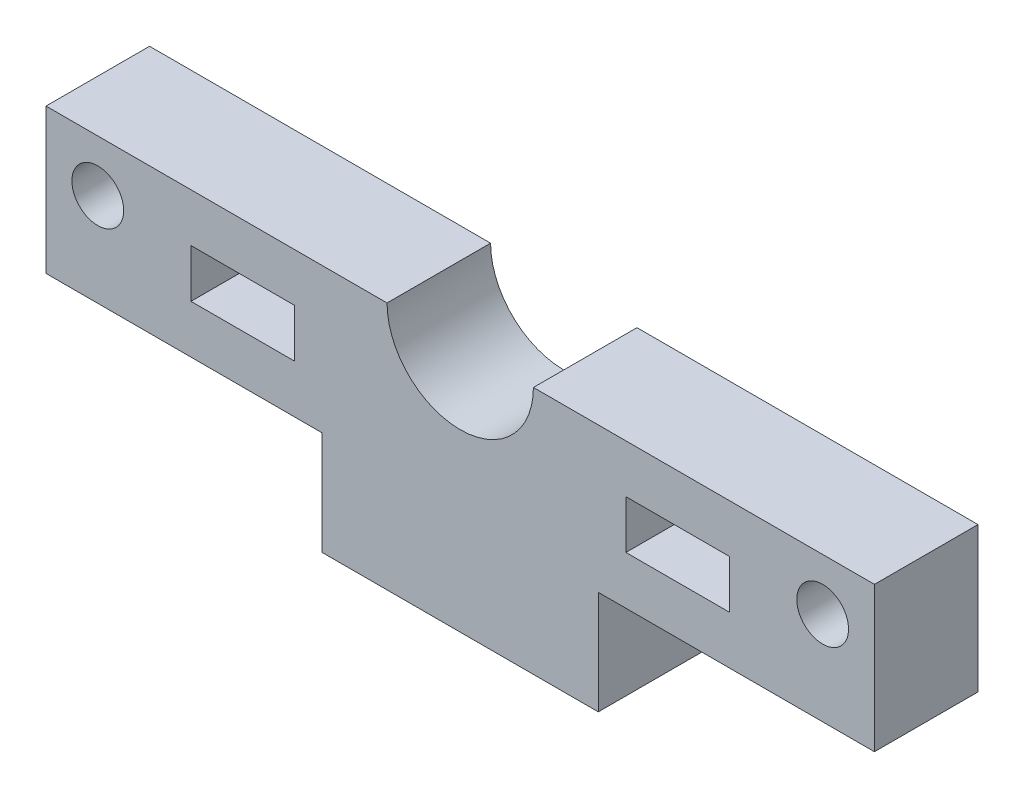
ISO-10303-21;
HEADER;
FILE_DESCRIPTION(('STEP AP214'),'2;1');
FILE_NAME('part.step','',(''),(''),'','','');
FILE_SCHEMA(('AUTOMOTIVE_DESIGN { 1 0 10303 214 1 1 1 1 }'));
ENDSEC;
DATA;
#1=APPLICATION_CONTEXT('core data for automotive mechanical design processes');
#2=APPLICATION_PROTOCOL_DEFINITION('international standard','automotive_design',2000,#1);
#3=PRODUCT_CONTEXT('',#1,'mechanical');
#4=PRODUCT('Part','Part','',(#3));
#5=PRODUCT_RELATED_PRODUCT_CATEGORY('part','',(#4));
#6=PRODUCT_DEFINITION_FORMATION('','',#4);
#7=PRODUCT_DEFINITION_CONTEXT('part definition',#1,'design');
#8=PRODUCT_DEFINITION('design','',#6,#7);
#9=PRODUCT_DEFINITION_SHAPE('','',#8);
#10=(LENGTH_UNIT() NAMED_UNIT(*) SI_UNIT(.MILLI.,.METRE.));
#11=(NAMED_UNIT(*) PLANE_ANGLE_UNIT() SI_UNIT($,.RADIAN.));
#12=(NAMED_UNIT(*) SI_UNIT($,.STERADIAN.) SOLID_ANGLE_UNIT());
#13=UNCERTAINTY_MEASURE_WITH_UNIT(LENGTH_MEASURE(1.E-05),#10,'distance_accuracy_value','');
#14=(GEOMETRIC_REPRESENTATION_CONTEXT(3) GLOBAL_UNCERTAINTY_ASSIGNED_CONTEXT((#13)) GLOBAL_UNIT_ASSIGNED_CONTEXT((#10,
#11,#12)) REPRESENTATION_CONTEXT('',''));
#15=CARTESIAN_POINT('',(0.,0.,0.));
#16=DIRECTION('',(0.,0.,1.));
#17=DIRECTION('',(1.,0.,0.));
#18=AXIS2_PLACEMENT_3D('',#15,#16,#17);
#19=CARTESIAN_POINT('',(0.,0.,6.35));
#20=DIRECTION('',(0.,0.,-1.));
#21=DIRECTION('',(-1.,0.,0.));
#22=AXIS2_PLACEMENT_3D('',#19,#20,#21);
#23=PLANE('',#22);
#24=DIRECTION('',(0.,1.,0.));
#25=VECTOR('',#24,1.);
#26=CARTESIAN_POINT('',(35.56,6.55436781609194,6.34999999999999));
#27=LINE('',#26,#25);
#28=CARTESIAN_POINT('',(35.56,6.55436781609194,6.34999999999999));
#29=VERTEX_POINT('',#28);
#30=CARTESIAN_POINT('',(35.56,9.51770114942527,6.34999999999999));
#31=VERTEX_POINT('',#30);
#32=EDGE_CURVE('E189',#29,#31,#27,.T.);
#33=ORIENTED_EDGE('',*,*,#32,.T.);
#34=DIRECTION('',(1.,0.,0.));
#35=VECTOR('',#34,1.);
#36=CARTESIAN_POINT('',(35.56,9.51770114942527,6.34999999999999));
#37=LINE('',#36,#35);
#38=CARTESIAN_POINT('',(41.91,9.51770114942527,6.34999999999999));
#39=VERTEX_POINT('',#38);
#40=EDGE_CURVE('E210',#31,#39,#37,.T.);
#41=ORIENTED_EDGE('',*,*,#40,.T.);
#42=DIRECTION('',(0.,1.,0.));
#43=VECTOR('',#42,1.);
#44=CARTESIAN_POINT('',(41.91,6.55436781609194,6.34999999999999));
#45=LINE('',#44,#43);
#46=CARTESIAN_POINT('',(41.91,6.55436781609194,6.35));
#47=VERTEX_POINT('',#46);
#48=EDGE_CURVE('E199',#47,#39,#45,.T.);
#49=ORIENTED_EDGE('',*,*,#48,.F.);
#50=DIRECTION('',(1.,0.,0.));
#51=VECTOR('',#50,1.);
#52=CARTESIAN_POINT('',(35.56,6.55436781609194,6.34999999999999));
#53=LINE('',#52,#51);
#54=EDGE_CURVE('E208',#29,#47,#53,.T.);
#55=ORIENTED_EDGE('',*,*,#54,.F.);
#56=EDGE_LOOP('',(#33,#41,#49,#55));
#57=FACE_BOUND('',#56,.T.);
#58=CARTESIAN_POINT('',(3.175,9.30603448275861,6.35));
#59=DIRECTION('',(0.,0.,-1.));
#60=DIRECTION('',(-1.,0.,0.));
#61=AXIS2_PLACEMENT_3D('',#58,#59,#60);
#62=CIRCLE('',#61,1.5875);
#63=CARTESIAN_POINT('',(1.5875,9.30603448275861,6.35));
#64=VERTEX_POINT('',#63);
#65=EDGE_CURVE('E224',#64,#64,#62,.T.);
#66=ORIENTED_EDGE('',*,*,#65,.T.);
#67=EDGE_LOOP('',(#66));
#68=FACE_BOUND('',#67,.T.);
#69=CARTESIAN_POINT('',(47.625,9.30603448275861,6.35));
#70=DIRECTION('',(0.,0.,-1.));
#71=DIRECTION('',(-1.,0.,0.));
#72=AXIS2_PLACEMENT_3D('',#69,#70,#71);
#73=CIRCLE('',#72,1.5875);
#74=CARTESIAN_POINT('',(46.0375,9.30603448275861,6.35));
#75=VERTEX_POINT('',#74);
#76=EDGE_CURVE('E230',#75,#75,#73,.T.);
#77=ORIENTED_EDGE('',*,*,#76,.T.);
#78=EDGE_LOOP('',(#77));
#79=FACE_BOUND('',#78,.T.);
#80=DIRECTION('',(-1.,0.,0.));
#81=VECTOR('',#80,1.);
#82=CARTESIAN_POINT('',(0.,12.4810344827586,6.35));
#83=LINE('',#82,#81);
#84=CARTESIAN_POINT('',(50.8,12.4810344827586,6.35));
#85=VERTEX_POINT('',#84);
#86=CARTESIAN_POINT('',(29.8879826102713,12.4810344827586,6.35));
#87=VERTEX_POINT('',#86);
#88=EDGE_CURVE('E241',#85,#87,#83,.T.);
#89=ORIENTED_EDGE('',*,*,#88,.T.);
#90=CARTESIAN_POINT('',(25.4,12.4810344827586,6.35));
#91=DIRECTION('',(0.,0.,-1.));
#92=DIRECTION('',(-1.,0.,0.));
#93=AXIS2_PLACEMENT_3D('',#90,#91,#92);
#94=CIRCLE('',#93,4.48798261027129);
#95=CARTESIAN_POINT('',(20.9120173897287,12.4810344827586,6.35));
#96=VERTEX_POINT('',#95);
#97=EDGE_CURVE('E207',#87,#96,#94,.T.);
#98=ORIENTED_EDGE('',*,*,#97,.T.);
#99=CARTESIAN_POINT('',(0.,12.4810344827586,6.35));
#100=VERTEX_POINT('',#99);
#101=EDGE_CURVE('E239',#96,#100,#83,.T.);
#102=ORIENTED_EDGE('',*,*,#101,.T.);
#103=DIRECTION('',(0.,-1.,0.));
#104=VECTOR('',#103,1.);
#105=CARTESIAN_POINT('',(0.,3.59103448275862,6.35));
#106=LINE('',#105,#104);
#107=CARTESIAN_POINT('',(0.,3.59103448275862,6.35));
#108=VERTEX_POINT('',#107);
#109=EDGE_CURVE('E244',#100,#108,#106,.T.);
#110=ORIENTED_EDGE('',*,*,#109,.T.);
#111=DIRECTION('',(1.,0.,0.));
#112=VECTOR('',#111,1.);
#113=CARTESIAN_POINT('',(0.,3.59103448275862,6.35));
#114=LINE('',#113,#112);
#115=CARTESIAN_POINT('',(16.9333333333333,3.59103448275862,6.35));
#116=VERTEX_POINT('',#115);
#117=EDGE_CURVE('E246',#108,#116,#114,.T.);
#118=ORIENTED_EDGE('',*,*,#117,.T.);
#119=DIRECTION('',(0.,-1.,0.));
#120=VECTOR('',#119,1.);
#121=CARTESIAN_POINT('',(16.9333333333333,-2.75896551724139,6.35));
#122=LINE('',#121,#120);
#123=CARTESIAN_POINT('',(16.9333333333333,-2.75896551724139,6.35));
#124=VERTEX_POINT('',#123);
#125=EDGE_CURVE('E248',#116,#124,#122,.T.);
#126=ORIENTED_EDGE('',*,*,#125,.T.);
#127=DIRECTION('',(1.,0.,0.));
#128=VECTOR('',#127,1.);
#129=CARTESIAN_POINT('',(16.9333333333333,-2.75896551724139,6.35));
#130=LINE('',#129,#128);
#131=CARTESIAN_POINT('',(33.8666666666667,-2.75896551724139,6.35));
#132=VERTEX_POINT('',#131);
#133=EDGE_CURVE('E250',#124,#132,#130,.T.);
#134=ORIENTED_EDGE('',*,*,#133,.T.);
#135=DIRECTION('',(0.,1.,0.));
#136=VECTOR('',#135,1.);
#137=CARTESIAN_POINT('',(33.8666666666667,-2.75896551724139,6.35));
#138=LINE('',#137,#136);
#139=CARTESIAN_POINT('',(33.8666666666667,3.59103448275862,6.35));
#140=VERTEX_POINT('',#139);
#141=EDGE_CURVE('E252',#132,#140,#138,.T.);
#142=ORIENTED_EDGE('',*,*,#141,.T.);
#143=DIRECTION('',(1.,0.,0.));
#144=VECTOR('',#143,1.);
#145=CARTESIAN_POINT('',(50.8,3.59103448275862,6.35));
#146=LINE('',#145,#144);
#147=CARTESIAN_POINT('',(50.8,3.59103448275862,6.35));
#148=VERTEX_POINT('',#147);
#149=EDGE_CURVE('E254',#140,#148,#146,.T.);
#150=ORIENTED_EDGE('',*,*,#149,.T.);
#151=DIRECTION('',(0.,1.,0.));
#152=VECTOR('',#151,1.);
#153=CARTESIAN_POINT('',(50.8,3.59103448275862,6.35));
#154=LINE('',#153,#152);
#155=EDGE_CURVE('E236',#148,#85,#154,.T.);
#156=ORIENTED_EDGE('',*,*,#155,.T.);
#157=EDGE_LOOP('',(#89,#98,#102,#110,#118,#126,#134,#142,#150,#156));
#158=FACE_BOUND('',#157,.T.);
#159=DIRECTION('',(0.,1.,0.));
#160=VECTOR('',#159,1.);
#161=CARTESIAN_POINT('',(8.89,6.55436781609194,6.34999999999999));
#162=LINE('',#161,#160);
#163=CARTESIAN_POINT('',(8.89,6.55436781609194,6.34999999999999));
#164=VERTEX_POINT('',#163);
#165=CARTESIAN_POINT('',(8.89,9.51770114942527,6.34999999999999));
#166=VERTEX_POINT('',#165);
#167=EDGE_CURVE('E176',#164,#166,#162,.T.);
#168=ORIENTED_EDGE('',*,*,#167,.T.);
#169=DIRECTION('',(1.,0.,0.));
#170=VECTOR('',#169,1.);
#171=CARTESIAN_POINT('',(8.89,9.51770114942527,6.34999999999999));
#172=LINE('',#171,#170);
#173=CARTESIAN_POINT('',(15.24,9.51770114942527,6.34999999999999));
#174=VERTEX_POINT('',#173);
#175=EDGE_CURVE('E175',#166,#174,#172,.T.);
#176=ORIENTED_EDGE('',*,*,#175,.T.);
#177=DIRECTION('',(0.,1.,0.));
#178=VECTOR('',#177,1.);
#179=CARTESIAN_POINT('',(15.24,6.55436781609194,6.34999999999999));
#180=LINE('',#179,#178);
#181=CARTESIAN_POINT('',(15.24,6.55436781609194,6.35));
#182=VERTEX_POINT('',#181);
#183=EDGE_CURVE('E305',#182,#174,#180,.T.);
#184=ORIENTED_EDGE('',*,*,#183,.F.);
#185=DIRECTION('',(1.,0.,0.));
#186=VECTOR('',#185,1.);
#187=CARTESIAN_POINT('',(8.89,6.55436781609194,6.34999999999999));
#188=LINE('',#187,#186);
#189=EDGE_CURVE('E50',#164,#182,#188,.T.);
#190=ORIENTED_EDGE('',*,*,#189,.F.);
#191=EDGE_LOOP('',(#168,#176,#184,#190));
#192=FACE_BOUND('',#191,.T.);
#193=ADVANCED_FACE('F35',(#57,#68,#79,#158,#192),#23,.F.);
#194=CARTESIAN_POINT('',(0.,12.4810344827586,6.35));
#195=DIRECTION('',(0.,-1.,0.));
#196=DIRECTION('',(1.,0.,0.));
#197=AXIS2_PLACEMENT_3D('',#194,#195,#196);
#198=PLANE('',#197);
#199=ORIENTED_EDGE('',*,*,#101,.F.);
#200=DIRECTION('',(0.,0.,-1.));
#201=VECTOR('',#200,1.);
#202=CARTESIAN_POINT('',(20.9120173897287,12.4810344827586,6.35));
#203=LINE('',#202,#201);
#204=CARTESIAN_POINT('',(20.9120173897287,12.4810344827586,0.));
#205=VERTEX_POINT('',#204);
#206=EDGE_CURVE('E220',#96,#205,#203,.T.);
#207=ORIENTED_EDGE('',*,*,#206,.T.);
#208=DIRECTION('',(-1.,0.,0.));
#209=VECTOR('',#208,1.);
#210=CARTESIAN_POINT('',(0.,12.4810344827586,0.));
#211=LINE('',#210,#209);
#212=CARTESIAN_POINT('',(0.,12.4810344827586,0.));
#213=VERTEX_POINT('',#212);
#214=EDGE_CURVE('E259',#205,#213,#211,.T.);
#215=ORIENTED_EDGE('',*,*,#214,.T.);
#216=DIRECTION('',(0.,0.,-1.));
#217=VECTOR('',#216,1.);
#218=CARTESIAN_POINT('',(0.,12.4810344827586,6.35));
#219=LINE('',#218,#217);
#220=EDGE_CURVE('E290',#100,#213,#219,.T.);
#221=ORIENTED_EDGE('',*,*,#220,.F.);
#222=EDGE_LOOP('',(#199,#207,#215,#221));
#223=FACE_BOUND('',#222,.T.);
#224=ADVANCED_FACE('F313',(#223),#198,.F.);
#225=CARTESIAN_POINT('',(50.8,3.59103448275862,6.35));
#226=DIRECTION('',(-1.,0.,0.));
#227=DIRECTION('',(0.,0.,1.));
#228=AXIS2_PLACEMENT_3D('',#225,#226,#227);
#229=PLANE('',#228);
#230=DIRECTION('',(0.,1.,0.));
#231=VECTOR('',#230,1.);
#232=CARTESIAN_POINT('',(50.8,3.59103448275862,0.));
#233=LINE('',#232,#231);
#234=CARTESIAN_POINT('',(50.8,3.59103448275862,0.));
#235=VERTEX_POINT('',#234);
#236=CARTESIAN_POINT('',(50.8,12.4810344827586,0.));
#237=VERTEX_POINT('',#236);
#238=EDGE_CURVE('E233',#235,#237,#233,.T.);
#239=ORIENTED_EDGE('',*,*,#238,.T.);
#240=DIRECTION('',(0.,0.,-1.));
#241=VECTOR('',#240,1.);
#242=CARTESIAN_POINT('',(50.8,12.4810344827586,6.35));
#243=LINE('',#242,#241);
#244=EDGE_CURVE('E293',#85,#237,#243,.T.);
#245=ORIENTED_EDGE('',*,*,#244,.F.);
#246=ORIENTED_EDGE('',*,*,#155,.F.);
#247=DIRECTION('',(0.,0.,-1.));
#248=VECTOR('',#247,1.);
#249=CARTESIAN_POINT('',(50.8,3.59103448275862,6.35));
#250=LINE('',#249,#248);
#251=EDGE_CURVE('E256',#148,#235,#250,.T.);
#252=ORIENTED_EDGE('',*,*,#251,.T.);
#253=EDGE_LOOP('',(#239,#245,#246,#252));
#254=FACE_BOUND('',#253,.T.);
#255=ADVANCED_FACE('F37',(#254),#229,.F.);
#256=CARTESIAN_POINT('',(29.8879826102713,12.4810344827586,0.));
#257=VERTEX_POINT('',#256);
#258=EDGE_CURVE('E260',#237,#257,#211,.T.);
#259=ORIENTED_EDGE('',*,*,#258,.T.);
#260=DIRECTION('',(0.,0.,-1.));
#261=VECTOR('',#260,1.);
#262=CARTESIAN_POINT('',(29.8879826102713,12.4810344827586,6.35));
#263=LINE('',#262,#261);
#264=EDGE_CURVE('E217',#257,#87,#263,.F.);
#265=ORIENTED_EDGE('',*,*,#264,.T.);
#266=ORIENTED_EDGE('',*,*,#88,.F.);
#267=ORIENTED_EDGE('',*,*,#244,.T.);
#268=EDGE_LOOP('',(#259,#265,#266,#267));
#269=FACE_BOUND('',#268,.T.);
#270=ADVANCED_FACE('F321',(#269),#198,.F.);
#271=CARTESIAN_POINT('',(0.,3.59103448275862,6.35));
#272=DIRECTION('',(1.,0.,0.));
#273=DIRECTION('',(0.,0.,-1.));
#274=AXIS2_PLACEMENT_3D('',#271,#272,#273);
#275=PLANE('',#274);
#276=DIRECTION('',(0.,-1.,0.));
#277=VECTOR('',#276,1.);
#278=CARTESIAN_POINT('',(0.,3.59103448275862,0.));
#279=LINE('',#278,#277);
#280=CARTESIAN_POINT('',(0.,3.59103448275862,0.));
#281=VERTEX_POINT('',#280);
#282=EDGE_CURVE('E262',#213,#281,#279,.T.);
#283=ORIENTED_EDGE('',*,*,#282,.T.);
#284=DIRECTION('',(0.,0.,-1.));
#285=VECTOR('',#284,1.);
#286=CARTESIAN_POINT('',(0.,3.59103448275862,6.35));
#287=LINE('',#286,#285);
#288=EDGE_CURVE('E287',#108,#281,#287,.T.);
#289=ORIENTED_EDGE('',*,*,#288,.F.);
#290=ORIENTED_EDGE('',*,*,#109,.F.);
#291=ORIENTED_EDGE('',*,*,#220,.T.);
#292=EDGE_LOOP('',(#283,#289,#290,#291));
#293=FACE_BOUND('',#292,.T.);
#294=ADVANCED_FACE('F348',(#293),#275,.F.);
#295=CARTESIAN_POINT('',(0.,3.59103448275862,6.35));
#296=DIRECTION('',(0.,1.,0.));
#297=DIRECTION('',(0.,0.,1.));
#298=AXIS2_PLACEMENT_3D('',#295,#296,#297);
#299=PLANE('',#298);
#300=DIRECTION('',(1.,0.,0.));
#301=VECTOR('',#300,1.);
#302=CARTESIAN_POINT('',(0.,3.59103448275862,0.));
#303=LINE('',#302,#301);
#304=CARTESIAN_POINT('',(16.9333333333333,3.59103448275862,0.));
#305=VERTEX_POINT('',#304);
#306=EDGE_CURVE('E264',#281,#305,#303,.T.);
#307=ORIENTED_EDGE('',*,*,#306,.T.);
#308=DIRECTION('',(0.,0.,-1.));
#309=VECTOR('',#308,1.);
#310=CARTESIAN_POINT('',(16.9333333333333,3.59103448275862,6.35));
#311=LINE('',#310,#309);
#312=EDGE_CURVE('E284',#116,#305,#311,.T.);
#313=ORIENTED_EDGE('',*,*,#312,.F.);
#314=ORIENTED_EDGE('',*,*,#117,.F.);
#315=ORIENTED_EDGE('',*,*,#288,.T.);
#316=EDGE_LOOP('',(#307,#313,#314,#315));
#317=FACE_BOUND('',#316,.T.);
#318=ADVANCED_FACE('F344',(#317),#299,.F.);
#319=CARTESIAN_POINT('',(16.9333333333333,-2.75896551724139,6.35));
#320=DIRECTION('',(1.,0.,0.));
#321=DIRECTION('',(0.,0.,-1.));
#322=AXIS2_PLACEMENT_3D('',#319,#320,#321);
#323=PLANE('',#322);
#324=DIRECTION('',(0.,-1.,0.));
#325=VECTOR('',#324,1.);
#326=CARTESIAN_POINT('',(16.9333333333333,-2.75896551724139,0.));
#327=LINE('',#326,#325);
#328=CARTESIAN_POINT('',(16.9333333333333,-2.75896551724139,0.));
#329=VERTEX_POINT('',#328);
#330=EDGE_CURVE('E266',#305,#329,#327,.T.);
#331=ORIENTED_EDGE('',*,*,#330,.T.);
#332=DIRECTION('',(0.,0.,-1.));
#333=VECTOR('',#332,1.);
#334=CARTESIAN_POINT('',(16.9333333333333,-2.75896551724139,6.35));
#335=LINE('',#334,#333);
#336=EDGE_CURVE('E281',#124,#329,#335,.T.);
#337=ORIENTED_EDGE('',*,*,#336,.F.);
#338=ORIENTED_EDGE('',*,*,#125,.F.);
#339=ORIENTED_EDGE('',*,*,#312,.T.);
#340=EDGE_LOOP('',(#331,#337,#338,#339));
#341=FACE_BOUND('',#340,.T.);
#342=ADVANCED_FACE('F340',(#341),#323,.F.);
#343=CARTESIAN_POINT('',(16.9333333333333,-2.75896551724139,6.35));
#344=DIRECTION('',(0.,1.,0.));
#345=DIRECTION('',(0.,0.,1.));
#346=AXIS2_PLACEMENT_3D('',#343,#344,#345);
#347=PLANE('',#346);
#348=DIRECTION('',(1.,0.,0.));
#349=VECTOR('',#348,1.);
#350=CARTESIAN_POINT('',(16.9333333333333,-2.75896551724139,0.));
#351=LINE('',#350,#349);
#352=CARTESIAN_POINT('',(33.8666666666667,-2.75896551724139,0.));
#353=VERTEX_POINT('',#352);
#354=EDGE_CURVE('E268',#329,#353,#351,.T.);
#355=ORIENTED_EDGE('',*,*,#354,.T.);
#356=DIRECTION('',(0.,0.,-1.));
#357=VECTOR('',#356,1.);
#358=CARTESIAN_POINT('',(33.8666666666667,-2.75896551724139,6.35));
#359=LINE('',#358,#357);
#360=EDGE_CURVE('E278',#132,#353,#359,.T.);
#361=ORIENTED_EDGE('',*,*,#360,.F.);
#362=ORIENTED_EDGE('',*,*,#133,.F.);
#363=ORIENTED_EDGE('',*,*,#336,.T.);
#364=EDGE_LOOP('',(#355,#361,#362,#363));
#365=FACE_BOUND('',#364,.T.);
#366=ADVANCED_FACE('F336',(#365),#347,.F.);
#367=CARTESIAN_POINT('',(33.8666666666667,-2.75896551724139,6.35));
#368=DIRECTION('',(-1.,0.,0.));
#369=DIRECTION('',(0.,0.,1.));
#370=AXIS2_PLACEMENT_3D('',#367,#368,#369);
#371=PLANE('',#370);
#372=DIRECTION('',(0.,1.,0.));
#373=VECTOR('',#372,1.);
#374=CARTESIAN_POINT('',(33.8666666666667,-2.75896551724139,0.));
#375=LINE('',#374,#373);
#376=CARTESIAN_POINT('',(33.8666666666667,3.59103448275862,0.));
#377=VERTEX_POINT('',#376);
#378=EDGE_CURVE('E270',#353,#377,#375,.T.);
#379=ORIENTED_EDGE('',*,*,#378,.T.);
#380=DIRECTION('',(0.,0.,-1.));
#381=VECTOR('',#380,1.);
#382=CARTESIAN_POINT('',(33.8666666666667,3.59103448275862,6.35));
#383=LINE('',#382,#381);
#384=EDGE_CURVE('E275',#140,#377,#383,.T.);
#385=ORIENTED_EDGE('',*,*,#384,.F.);
#386=ORIENTED_EDGE('',*,*,#141,.F.);
#387=ORIENTED_EDGE('',*,*,#360,.T.);
#388=EDGE_LOOP('',(#379,#385,#386,#387));
#389=FACE_BOUND('',#388,.T.);
#390=ADVANCED_FACE('F332',(#389),#371,.F.);
#391=CARTESIAN_POINT('',(50.8,3.59103448275862,6.35));
#392=DIRECTION('',(0.,1.,0.));
#393=DIRECTION('',(0.,0.,1.));
#394=AXIS2_PLACEMENT_3D('',#391,#392,#393);
#395=PLANE('',#394);
#396=DIRECTION('',(1.,0.,0.));
#397=VECTOR('',#396,1.);
#398=CARTESIAN_POINT('',(50.8,3.59103448275862,0.));
#399=LINE('',#398,#397);
#400=EDGE_CURVE('E240',#377,#235,#399,.T.);
#401=ORIENTED_EDGE('',*,*,#400,.T.);
#402=ORIENTED_EDGE('',*,*,#251,.F.);
#403=ORIENTED_EDGE('',*,*,#149,.F.);
#404=ORIENTED_EDGE('',*,*,#384,.T.);
#405=EDGE_LOOP('',(#401,#402,#403,#404));
#406=FACE_BOUND('',#405,.T.);
#407=ADVANCED_FACE('F329',(#406),#395,.F.);
#408=CARTESIAN_POINT('',(0.,0.,0.));
#409=DIRECTION('',(0.,0.,-1.));
#410=DIRECTION('',(-1.,0.,0.));
#411=AXIS2_PLACEMENT_3D('',#408,#409,#410);
#412=PLANE('',#411);
#413=DIRECTION('',(1.,0.,0.));
#414=VECTOR('',#413,1.);
#415=CARTESIAN_POINT('',(8.89,9.51770114942527,0.));
#416=LINE('',#415,#414);
#417=CARTESIAN_POINT('',(8.89,9.51770114942527,0.));
#418=VERTEX_POINT('',#417);
#419=CARTESIAN_POINT('',(15.24,9.51770114942527,0.));
#420=VERTEX_POINT('',#419);
#421=EDGE_CURVE('E172',#418,#420,#416,.T.);
#422=ORIENTED_EDGE('',*,*,#421,.F.);
#423=DIRECTION('',(0.,-1.,0.));
#424=VECTOR('',#423,1.);
#425=CARTESIAN_POINT('',(8.89,0.,0.));
#426=LINE('',#425,#424);
#427=CARTESIAN_POINT('',(8.89,6.55436781609194,0.));
#428=VERTEX_POINT('',#427);
#429=EDGE_CURVE('E11',#418,#428,#426,.T.);
#430=ORIENTED_EDGE('',*,*,#429,.T.);
#431=DIRECTION('',(1.,0.,0.));
#432=VECTOR('',#431,1.);
#433=CARTESIAN_POINT('',(8.89,6.55436781609194,0.));
#434=LINE('',#433,#432);
#435=CARTESIAN_POINT('',(15.24,6.55436781609194,0.));
#436=VERTEX_POINT('',#435);
#437=EDGE_CURVE('E200',#428,#436,#434,.T.);
#438=ORIENTED_EDGE('',*,*,#437,.T.);
#439=DIRECTION('',(0.,-1.,0.));
#440=VECTOR('',#439,1.);
#441=CARTESIAN_POINT('',(15.24,0.,0.));
#442=LINE('',#441,#440);
#443=EDGE_CURVE('E43',#420,#436,#442,.T.);
#444=ORIENTED_EDGE('',*,*,#443,.F.);
#445=EDGE_LOOP('',(#422,#430,#438,#444));
#446=FACE_BOUND('',#445,.T.);
#447=ORIENTED_EDGE('',*,*,#282,.F.);
#448=ORIENTED_EDGE('',*,*,#214,.F.);
#449=CARTESIAN_POINT('',(25.4,12.4810344827586,0.));
#450=DIRECTION('',(0.,0.,-1.));
#451=DIRECTION('',(-1.,0.,0.));
#452=AXIS2_PLACEMENT_3D('',#449,#450,#451);
#453=CIRCLE('',#452,4.48798261027129);
#454=EDGE_CURVE('E296',#257,#205,#453,.T.);
#455=ORIENTED_EDGE('',*,*,#454,.F.);
#456=ORIENTED_EDGE('',*,*,#258,.F.);
#457=ORIENTED_EDGE('',*,*,#238,.F.);
#458=ORIENTED_EDGE('',*,*,#400,.F.);
#459=ORIENTED_EDGE('',*,*,#378,.F.);
#460=ORIENTED_EDGE('',*,*,#354,.F.);
#461=ORIENTED_EDGE('',*,*,#330,.F.);
#462=ORIENTED_EDGE('',*,*,#306,.F.);
#463=EDGE_LOOP('',(#447,#448,#455,#456,#457,#458,#459,#460,#461,#462));
#464=FACE_BOUND('',#463,.T.);
#465=DIRECTION('',(1.,0.,0.));
#466=VECTOR('',#465,1.);
#467=CARTESIAN_POINT('',(35.56,9.51770114942527,0.));
#468=LINE('',#467,#466);
#469=CARTESIAN_POINT('',(35.56,9.51770114942527,0.));
#470=VERTEX_POINT('',#469);
#471=CARTESIAN_POINT('',(41.91,9.51770114942527,0.));
#472=VERTEX_POINT('',#471);
#473=EDGE_CURVE('E195',#470,#472,#468,.T.);
#474=ORIENTED_EDGE('',*,*,#473,.F.);
#475=DIRECTION('',(0.,-1.,0.));
#476=VECTOR('',#475,1.);
#477=CARTESIAN_POINT('',(35.56,0.,0.));
#478=LINE('',#477,#476);
#479=CARTESIAN_POINT('',(35.56,6.55436781609194,0.));
#480=VERTEX_POINT('',#479);
#481=EDGE_CURVE('E300',#470,#480,#478,.T.);
#482=ORIENTED_EDGE('',*,*,#481,.T.);
#483=DIRECTION('',(1.,0.,0.));
#484=VECTOR('',#483,1.);
#485=CARTESIAN_POINT('',(35.56,6.55436781609194,0.));
#486=LINE('',#485,#484);
#487=CARTESIAN_POINT('',(41.91,6.55436781609194,0.));
#488=VERTEX_POINT('',#487);
#489=EDGE_CURVE('E204',#480,#488,#486,.T.);
#490=ORIENTED_EDGE('',*,*,#489,.T.);
#491=DIRECTION('',(0.,-1.,0.));
#492=VECTOR('',#491,1.);
#493=CARTESIAN_POINT('',(41.91,0.,0.));
#494=LINE('',#493,#492);
#495=EDGE_CURVE('E298',#472,#488,#494,.T.);
#496=ORIENTED_EDGE('',*,*,#495,.F.);
#497=EDGE_LOOP('',(#474,#482,#490,#496));
#498=FACE_BOUND('',#497,.T.);
#499=CARTESIAN_POINT('',(47.625,9.30603448275861,0.));
#500=DIRECTION('',(0.,0.,-1.));
#501=DIRECTION('',(-1.,0.,0.));
#502=AXIS2_PLACEMENT_3D('',#499,#500,#501);
#503=CIRCLE('',#502,1.5875);
#504=CARTESIAN_POINT('',(46.0375,9.30603448275861,0.));
#505=VERTEX_POINT('',#504);
#506=EDGE_CURVE('E227',#505,#505,#503,.T.);
#507=ORIENTED_EDGE('',*,*,#506,.F.);
#508=EDGE_LOOP('',(#507));
#509=FACE_BOUND('',#508,.T.);
#510=CARTESIAN_POINT('',(3.175,9.30603448275861,0.));
#511=DIRECTION('',(0.,0.,-1.));
#512=DIRECTION('',(-1.,0.,0.));
#513=AXIS2_PLACEMENT_3D('',#510,#511,#512);
#514=CIRCLE('',#513,1.5875);
#515=CARTESIAN_POINT('',(1.5875,9.30603448275861,0.));
#516=VERTEX_POINT('',#515);
#517=EDGE_CURVE('E223',#516,#516,#514,.T.);
#518=ORIENTED_EDGE('',*,*,#517,.F.);
#519=EDGE_LOOP('',(#518));
#520=FACE_BOUND('',#519,.T.);
#521=ADVANCED_FACE('F179',(#446,#464,#498,#509,#520),#412,.T.);
#522=CARTESIAN_POINT('',(47.625,9.30603448275861,6.35));
#523=DIRECTION('',(0.,0.,-1.));
#524=DIRECTION('',(-1.,0.,0.));
#525=AXIS2_PLACEMENT_3D('',#522,#523,#524);
#526=CYLINDRICAL_SURFACE('',#525,1.5875);
#527=ORIENTED_EDGE('',*,*,#76,.F.);
#528=EDGE_LOOP('',(#527));
#529=FACE_BOUND('',#528,.T.);
#530=ORIENTED_EDGE('',*,*,#506,.T.);
#531=EDGE_LOOP('',(#530));
#532=FACE_BOUND('',#531,.T.);
#533=ADVANCED_FACE('F325',(#529,#532),#526,.F.);
#534=CARTESIAN_POINT('',(3.175,9.30603448275861,6.35));
#535=DIRECTION('',(0.,0.,-1.));
#536=DIRECTION('',(-1.,0.,0.));
#537=AXIS2_PLACEMENT_3D('',#534,#535,#536);
#538=CYLINDRICAL_SURFACE('',#537,1.5875);
#539=ORIENTED_EDGE('',*,*,#65,.F.);
#540=EDGE_LOOP('',(#539));
#541=FACE_BOUND('',#540,.T.);
#542=ORIENTED_EDGE('',*,*,#517,.T.);
#543=EDGE_LOOP('',(#542));
#544=FACE_BOUND('',#543,.T.);
#545=ADVANCED_FACE('F395',(#541,#544),#538,.F.);
#546=CARTESIAN_POINT('',(25.4,12.4810344827586,6.35));
#547=DIRECTION('',(0.,0.,-1.));
#548=DIRECTION('',(-1.,0.,0.));
#549=AXIS2_PLACEMENT_3D('',#546,#547,#548);
#550=CYLINDRICAL_SURFACE('',#549,4.48798261027129);
#551=ORIENTED_EDGE('',*,*,#97,.F.);
#552=ORIENTED_EDGE('',*,*,#264,.F.);
#553=ORIENTED_EDGE('',*,*,#454,.T.);
#554=ORIENTED_EDGE('',*,*,#206,.F.);
#555=EDGE_LOOP('',(#551,#552,#553,#554));
#556=FACE_BOUND('',#555,.T.);
#557=ADVANCED_FACE('F363',(#556),#550,.F.);
#558=CARTESIAN_POINT('',(35.56,6.55436781609194,0.));
#559=DIRECTION('',(0.,1.,0.));
#560=DIRECTION('',(0.,0.,-1.));
#561=AXIS2_PLACEMENT_3D('',#558,#559,#560);
#562=PLANE('',#561);
#563=DIRECTION('',(0.,0.,1.));
#564=VECTOR('',#563,1.);
#565=CARTESIAN_POINT('',(41.91,6.55436781609194,0.));
#566=LINE('',#565,#564);
#567=EDGE_CURVE('E190',#488,#47,#566,.T.);
#568=ORIENTED_EDGE('',*,*,#567,.F.);
#569=ORIENTED_EDGE('',*,*,#489,.F.);
#570=DIRECTION('',(0.,0.,1.));
#571=VECTOR('',#570,1.);
#572=CARTESIAN_POINT('',(35.56,6.55436781609194,0.));
#573=LINE('',#572,#571);
#574=EDGE_CURVE('E193',#480,#29,#573,.T.);
#575=ORIENTED_EDGE('',*,*,#574,.T.);
#576=ORIENTED_EDGE('',*,*,#54,.T.);
#577=EDGE_LOOP('',(#568,#569,#575,#576));
#578=FACE_BOUND('',#577,.T.);
#579=ADVANCED_FACE('F403',(#578),#562,.T.);
#580=CARTESIAN_POINT('',(35.56,9.51770114942527,0.));
#581=DIRECTION('',(0.,1.,0.));
#582=DIRECTION('',(0.,0.,-1.));
#583=AXIS2_PLACEMENT_3D('',#580,#581,#582);
#584=PLANE('',#583);
#585=DIRECTION('',(0.,0.,1.));
#586=VECTOR('',#585,1.);
#587=CARTESIAN_POINT('',(41.91,9.51770114942527,0.));
#588=LINE('',#587,#586);
#589=EDGE_CURVE('E196',#472,#39,#588,.T.);
#590=ORIENTED_EDGE('',*,*,#589,.T.);
#591=ORIENTED_EDGE('',*,*,#40,.F.);
#592=DIRECTION('',(0.,0.,1.));
#593=VECTOR('',#592,1.);
#594=CARTESIAN_POINT('',(35.56,9.51770114942527,0.));
#595=LINE('',#594,#593);
#596=EDGE_CURVE('E186',#470,#31,#595,.T.);
#597=ORIENTED_EDGE('',*,*,#596,.F.);
#598=ORIENTED_EDGE('',*,*,#473,.T.);
#599=EDGE_LOOP('',(#590,#591,#597,#598));
#600=FACE_BOUND('',#599,.T.);
#601=ADVANCED_FACE('F408',(#600),#584,.F.);
#602=CARTESIAN_POINT('',(35.56,3.5910344827586,0.));
#603=DIRECTION('',(1.,0.,0.));
#604=DIRECTION('',(0.,-1.,0.));
#605=AXIS2_PLACEMENT_3D('',#602,#603,#604);
#606=PLANE('',#605);
#607=ORIENTED_EDGE('',*,*,#596,.T.);
#608=ORIENTED_EDGE('',*,*,#32,.F.);
#609=ORIENTED_EDGE('',*,*,#574,.F.);
#610=ORIENTED_EDGE('',*,*,#481,.F.);
#611=EDGE_LOOP('',(#607,#608,#609,#610));
#612=FACE_BOUND('',#611,.T.);
#613=ADVANCED_FACE('F411',(#612),#606,.T.);
#614=CARTESIAN_POINT('',(41.91,3.5910344827586,0.));
#615=DIRECTION('',(1.,0.,0.));
#616=DIRECTION('',(0.,-1.,0.));
#617=AXIS2_PLACEMENT_3D('',#614,#615,#616);
#618=PLANE('',#617);
#619=ORIENTED_EDGE('',*,*,#495,.T.);
#620=ORIENTED_EDGE('',*,*,#567,.T.);
#621=ORIENTED_EDGE('',*,*,#48,.T.);
#622=ORIENTED_EDGE('',*,*,#589,.F.);
#623=EDGE_LOOP('',(#619,#620,#621,#622));
#624=FACE_BOUND('',#623,.T.);
#625=ADVANCED_FACE('F416',(#624),#618,.F.);
#626=CARTESIAN_POINT('',(8.89,6.55436781609194,0.));
#627=DIRECTION('',(0.,1.,0.));
#628=DIRECTION('',(0.,0.,-1.));
#629=AXIS2_PLACEMENT_3D('',#626,#627,#628);
#630=PLANE('',#629);
#631=DIRECTION('',(0.,0.,1.));
#632=VECTOR('',#631,1.);
#633=CARTESIAN_POINT('',(15.24,6.55436781609194,0.));
#634=LINE('',#633,#632);
#635=EDGE_CURVE('E177',#436,#182,#634,.T.);
#636=ORIENTED_EDGE('',*,*,#635,.F.);
#637=ORIENTED_EDGE('',*,*,#437,.F.);
#638=DIRECTION('',(0.,0.,1.));
#639=VECTOR('',#638,1.);
#640=CARTESIAN_POINT('',(8.89,6.55436781609194,0.));
#641=LINE('',#640,#639);
#642=EDGE_CURVE('E166',#428,#164,#641,.T.);
#643=ORIENTED_EDGE('',*,*,#642,.T.);
#644=ORIENTED_EDGE('',*,*,#189,.T.);
#645=EDGE_LOOP('',(#636,#637,#643,#644));
#646=FACE_BOUND('',#645,.T.);
#647=ADVANCED_FACE('F304',(#646),#630,.T.);
#648=CARTESIAN_POINT('',(8.89,9.51770114942527,0.));
#649=DIRECTION('',(0.,1.,0.));
#650=DIRECTION('',(0.,0.,-1.));
#651=AXIS2_PLACEMENT_3D('',#648,#649,#650);
#652=PLANE('',#651);
#653=DIRECTION('',(0.,0.,1.));
#654=VECTOR('',#653,1.);
#655=CARTESIAN_POINT('',(15.24,9.51770114942527,0.));
#656=LINE('',#655,#654);
#657=EDGE_CURVE('E58',#420,#174,#656,.T.);
#658=ORIENTED_EDGE('',*,*,#657,.T.);
#659=ORIENTED_EDGE('',*,*,#175,.F.);
#660=DIRECTION('',(0.,0.,1.));
#661=VECTOR('',#660,1.);
#662=CARTESIAN_POINT('',(8.89,9.51770114942527,0.));
#663=LINE('',#662,#661);
#664=EDGE_CURVE('E164',#418,#166,#663,.T.);
#665=ORIENTED_EDGE('',*,*,#664,.F.);
#666=ORIENTED_EDGE('',*,*,#421,.T.);
#667=EDGE_LOOP('',(#658,#659,#665,#666));
#668=FACE_BOUND('',#667,.T.);
#669=ADVANCED_FACE('F171',(#668),#652,.F.);
#670=CARTESIAN_POINT('',(8.89,3.5910344827586,0.));
#671=DIRECTION('',(1.,0.,0.));
#672=DIRECTION('',(0.,-1.,0.));
#673=AXIS2_PLACEMENT_3D('',#670,#671,#672);
#674=PLANE('',#673);
#675=ORIENTED_EDGE('',*,*,#664,.T.);
#676=ORIENTED_EDGE('',*,*,#167,.F.);
#677=ORIENTED_EDGE('',*,*,#642,.F.);
#678=ORIENTED_EDGE('',*,*,#429,.F.);
#679=EDGE_LOOP('',(#675,#676,#677,#678));
#680=FACE_BOUND('',#679,.T.);
#681=ADVANCED_FACE('F162',(#680),#674,.T.);
#682=CARTESIAN_POINT('',(15.24,3.5910344827586,0.));
#683=DIRECTION('',(1.,0.,0.));
#684=DIRECTION('',(0.,-1.,0.));
#685=AXIS2_PLACEMENT_3D('',#682,#683,#684);
#686=PLANE('',#685);
#687=ORIENTED_EDGE('',*,*,#443,.T.);
#688=ORIENTED_EDGE('',*,*,#635,.T.);
#689=ORIENTED_EDGE('',*,*,#183,.T.);
#690=ORIENTED_EDGE('',*,*,#657,.F.);
#691=EDGE_LOOP('',(#687,#688,#689,#690));
#692=FACE_BOUND('',#691,.T.);
#693=ADVANCED_FACE('F302',(#692),#686,.F.);
#694=CLOSED_SHELL('',(#193,#224,#255,#270,#294,#318,#342,#366,#390,#407,#521,#533,#545,#557,
#579,#601,#613,#625,#647,#669,#681,#693));
#695=MANIFOLD_SOLID_BREP('B2',#694);
#696=ADVANCED_BREP_SHAPE_REPRESENTATION('',(#18,#695),#14);
#697=SHAPE_DEFINITION_REPRESENTATION(#9,#696);
ENDSEC;
END-ISO-10303-21;
